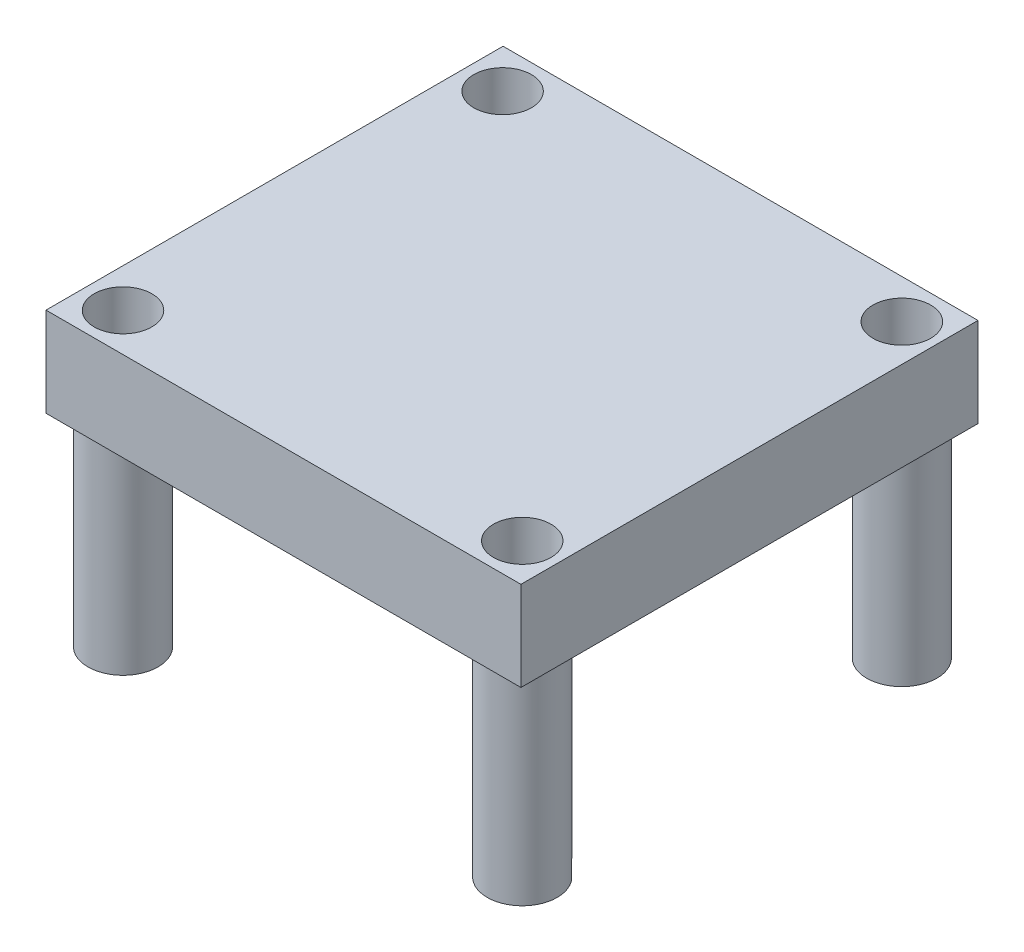
ISO-10303-21;
HEADER;
FILE_DESCRIPTION(('STEP AP214'),'2;1');
FILE_NAME('part.step','',(''),(''),'','','');
FILE_SCHEMA(('AUTOMOTIVE_DESIGN { 1 0 10303 214 1 1 1 1 }'));
ENDSEC;
DATA;
#1=APPLICATION_CONTEXT('core data for automotive mechanical design processes');
#2=APPLICATION_PROTOCOL_DEFINITION('international standard','automotive_design',2000,#1);
#3=PRODUCT_CONTEXT('',#1,'mechanical');
#4=PRODUCT('Part','Part','',(#3));
#5=PRODUCT_RELATED_PRODUCT_CATEGORY('part','',(#4));
#6=PRODUCT_DEFINITION_FORMATION('','',#4);
#7=PRODUCT_DEFINITION_CONTEXT('part definition',#1,'design');
#8=PRODUCT_DEFINITION('design','',#6,#7);
#9=PRODUCT_DEFINITION_SHAPE('','',#8);
#10=(LENGTH_UNIT() NAMED_UNIT(*) SI_UNIT(.MILLI.,.METRE.));
#11=(NAMED_UNIT(*) PLANE_ANGLE_UNIT() SI_UNIT($,.RADIAN.));
#12=(NAMED_UNIT(*) SI_UNIT($,.STERADIAN.) SOLID_ANGLE_UNIT());
#13=UNCERTAINTY_MEASURE_WITH_UNIT(LENGTH_MEASURE(1.E-05),#10,'distance_accuracy_value','');
#14=(GEOMETRIC_REPRESENTATION_CONTEXT(3) GLOBAL_UNCERTAINTY_ASSIGNED_CONTEXT((#13)) GLOBAL_UNIT_ASSIGNED_CONTEXT((#10,
#11,#12)) REPRESENTATION_CONTEXT('',''));
#15=CARTESIAN_POINT('',(0.,0.,0.));
#16=DIRECTION('',(0.,0.,1.));
#17=DIRECTION('',(1.,0.,0.));
#18=AXIS2_PLACEMENT_3D('',#15,#16,#17);
#19=CARTESIAN_POINT('',(-11.2828992805755,5.08,-10.6291690647482));
#20=DIRECTION('',(1.,0.,0.));
#21=DIRECTION('',(0.,0.,-1.));
#22=AXIS2_PLACEMENT_3D('',#19,#20,#21);
#23=PLANE('',#22);
#24=DIRECTION('',(0.,0.,1.));
#25=VECTOR('',#24,1.);
#26=CARTESIAN_POINT('',(-11.2828992805755,0.,-10.6291690647482));
#27=LINE('',#26,#25);
#28=CARTESIAN_POINT('',(-11.2828992805755,0.,-10.6291690647482));
#29=VERTEX_POINT('',#28);
#30=CARTESIAN_POINT('',(-11.2828992805755,0.,15.3550309352518));
#31=VERTEX_POINT('',#30);
#32=EDGE_CURVE('E104',#29,#31,#27,.T.);
#33=ORIENTED_EDGE('',*,*,#32,.T.);
#34=DIRECTION('',(0.,-1.,0.));
#35=VECTOR('',#34,1.);
#36=CARTESIAN_POINT('',(-11.2828992805755,5.08,15.3550309352518));
#37=LINE('',#36,#35);
#38=CARTESIAN_POINT('',(-11.2828992805755,5.08,15.3550309352518));
#39=VERTEX_POINT('',#38);
#40=EDGE_CURVE('E95',#39,#31,#37,.T.);
#41=ORIENTED_EDGE('',*,*,#40,.F.);
#42=DIRECTION('',(0.,0.,1.));
#43=VECTOR('',#42,1.);
#44=CARTESIAN_POINT('',(-11.2828992805755,5.08,-10.6291690647482));
#45=LINE('',#44,#43);
#46=CARTESIAN_POINT('',(-11.2828992805755,5.08,-10.6291690647482));
#47=VERTEX_POINT('',#46);
#48=EDGE_CURVE('E89',#47,#39,#45,.T.);
#49=ORIENTED_EDGE('',*,*,#48,.F.);
#50=DIRECTION('',(0.,-1.,0.));
#51=VECTOR('',#50,1.);
#52=CARTESIAN_POINT('',(-11.2828992805755,5.08,-10.6291690647482));
#53=LINE('',#52,#51);
#54=EDGE_CURVE('E100',#47,#29,#53,.T.);
#55=ORIENTED_EDGE('',*,*,#54,.T.);
#56=EDGE_LOOP('',(#33,#41,#49,#55));
#57=FACE_BOUND('',#56,.T.);
#58=ADVANCED_FACE('F37',(#57),#23,.F.);
#59=CARTESIAN_POINT('',(-11.2828992805755,5.08,15.3550309352518));
#60=DIRECTION('',(0.,0.,-1.));
#61=DIRECTION('',(-1.,0.,0.));
#62=AXIS2_PLACEMENT_3D('',#59,#60,#61);
#63=PLANE('',#62);
#64=DIRECTION('',(1.,0.,0.));
#65=VECTOR('',#64,1.);
#66=CARTESIAN_POINT('',(-11.2828992805755,0.,15.3550309352518));
#67=LINE('',#66,#65);
#68=CARTESIAN_POINT('',(15.7173007194245,0.,15.3550309352518));
#69=VERTEX_POINT('',#68);
#70=EDGE_CURVE('E94',#31,#69,#67,.T.);
#71=ORIENTED_EDGE('',*,*,#70,.T.);
#72=DIRECTION('',(0.,-1.,0.));
#73=VECTOR('',#72,1.);
#74=CARTESIAN_POINT('',(15.7173007194245,5.08,15.3550309352518));
#75=LINE('',#74,#73);
#76=CARTESIAN_POINT('',(15.7173007194245,5.08,15.3550309352518));
#77=VERTEX_POINT('',#76);
#78=EDGE_CURVE('E92',#77,#69,#75,.T.);
#79=ORIENTED_EDGE('',*,*,#78,.F.);
#80=DIRECTION('',(1.,0.,0.));
#81=VECTOR('',#80,1.);
#82=CARTESIAN_POINT('',(-11.2828992805755,5.08,15.3550309352518));
#83=LINE('',#82,#81);
#84=EDGE_CURVE('E84',#39,#77,#83,.T.);
#85=ORIENTED_EDGE('',*,*,#84,.F.);
#86=ORIENTED_EDGE('',*,*,#40,.T.);
#87=EDGE_LOOP('',(#71,#79,#85,#86));
#88=FACE_BOUND('',#87,.T.);
#89=ADVANCED_FACE('F93',(#88),#63,.F.);
#90=CARTESIAN_POINT('',(15.7173007194245,5.08,-10.6291690647482));
#91=DIRECTION('',(-1.,0.,0.));
#92=DIRECTION('',(0.,0.,1.));
#93=AXIS2_PLACEMENT_3D('',#90,#91,#92);
#94=PLANE('',#93);
#95=DIRECTION('',(0.,0.,-1.));
#96=VECTOR('',#95,1.);
#97=CARTESIAN_POINT('',(15.7173007194245,0.,-10.6291690647482));
#98=LINE('',#97,#96);
#99=CARTESIAN_POINT('',(15.7173007194245,0.,-10.6291690647482));
#100=VERTEX_POINT('',#99);
#101=EDGE_CURVE('E70',#69,#100,#98,.T.);
#102=ORIENTED_EDGE('',*,*,#101,.T.);
#103=DIRECTION('',(0.,-1.,0.));
#104=VECTOR('',#103,1.);
#105=CARTESIAN_POINT('',(15.7173007194245,5.08,-10.6291690647482));
#106=LINE('',#105,#104);
#107=CARTESIAN_POINT('',(15.7173007194245,5.08,-10.6291690647482));
#108=VERTEX_POINT('',#107);
#109=EDGE_CURVE('E96',#108,#100,#106,.T.);
#110=ORIENTED_EDGE('',*,*,#109,.F.);
#111=DIRECTION('',(0.,0.,-1.));
#112=VECTOR('',#111,1.);
#113=CARTESIAN_POINT('',(15.7173007194245,5.08,-10.6291690647482));
#114=LINE('',#113,#112);
#115=EDGE_CURVE('E87',#77,#108,#114,.T.);
#116=ORIENTED_EDGE('',*,*,#115,.F.);
#117=ORIENTED_EDGE('',*,*,#78,.T.);
#118=EDGE_LOOP('',(#102,#110,#116,#117));
#119=FACE_BOUND('',#118,.T.);
#120=ADVANCED_FACE('F98',(#119),#94,.F.);
#121=CARTESIAN_POINT('',(-11.2828992805755,5.08,-10.6291690647482));
#122=DIRECTION('',(0.,0.,1.));
#123=DIRECTION('',(1.,0.,0.));
#124=AXIS2_PLACEMENT_3D('',#121,#122,#123);
#125=PLANE('',#124);
#126=DIRECTION('',(-1.,0.,0.));
#127=VECTOR('',#126,1.);
#128=CARTESIAN_POINT('',(-11.2828992805755,0.,-10.6291690647482));
#129=LINE('',#128,#127);
#130=EDGE_CURVE('E76',#100,#29,#129,.T.);
#131=ORIENTED_EDGE('',*,*,#130,.T.);
#132=ORIENTED_EDGE('',*,*,#54,.F.);
#133=DIRECTION('',(-1.,0.,0.));
#134=VECTOR('',#133,1.);
#135=CARTESIAN_POINT('',(-11.2828992805755,5.08,-10.6291690647482));
#136=LINE('',#135,#134);
#137=EDGE_CURVE('E53',#108,#47,#136,.T.);
#138=ORIENTED_EDGE('',*,*,#137,.F.);
#139=ORIENTED_EDGE('',*,*,#109,.T.);
#140=EDGE_LOOP('',(#131,#132,#138,#139));
#141=FACE_BOUND('',#140,.T.);
#142=ADVANCED_FACE('F136',(#141),#125,.F.);
#143=CARTESIAN_POINT('',(0.,5.08,0.));
#144=DIRECTION('',(0.,1.,0.));
#145=DIRECTION('',(0.,0.,1.));
#146=AXIS2_PLACEMENT_3D('',#143,#144,#145);
#147=PLANE('',#146);
#148=CARTESIAN_POINT('',(-9.08269961067136,5.08,-8.40305308869703));
#149=DIRECTION('',(0.,1.,0.));
#150=DIRECTION('',(0.,0.,1.));
#151=AXIS2_PLACEMENT_3D('',#148,#149,#150);
#152=CIRCLE('',#151,1.6383);
#153=CARTESIAN_POINT('',(-9.08269961067136,5.08,-6.76475308869703));
#154=VERTEX_POINT('',#153);
#155=EDGE_CURVE('E353',#154,#154,#152,.T.);
#156=ORIENTED_EDGE('',*,*,#155,.F.);
#157=EDGE_LOOP('',(#156));
#158=FACE_BOUND('',#157,.T.);
#159=CARTESIAN_POINT('',(13.6127278506212,5.08,13.1767283597511));
#160=DIRECTION('',(0.,1.,0.));
#161=DIRECTION('',(0.,0.,1.));
#162=AXIS2_PLACEMENT_3D('',#159,#160,#161);
#163=CIRCLE('',#162,1.6383);
#164=CARTESIAN_POINT('',(13.6127278506212,5.08,14.8150283597511));
#165=VERTEX_POINT('',#164);
#166=EDGE_CURVE('E358',#165,#165,#163,.T.);
#167=ORIENTED_EDGE('',*,*,#166,.F.);
#168=EDGE_LOOP('',(#167));
#169=FACE_BOUND('',#168,.T.);
#170=CARTESIAN_POINT('',(-9.08269961067136,5.08,13.1767283597511));
#171=DIRECTION('',(0.,1.,0.));
#172=DIRECTION('',(0.,0.,1.));
#173=AXIS2_PLACEMENT_3D('',#170,#171,#172);
#174=CIRCLE('',#173,1.6383);
#175=CARTESIAN_POINT('',(-9.08269961067136,5.08,14.8150283597511));
#176=VERTEX_POINT('',#175);
#177=EDGE_CURVE('E387',#176,#176,#174,.T.);
#178=ORIENTED_EDGE('',*,*,#177,.F.);
#179=EDGE_LOOP('',(#178));
#180=FACE_BOUND('',#179,.T.);
#181=CARTESIAN_POINT('',(13.6127278506212,5.08,-8.40305308869703));
#182=DIRECTION('',(0.,1.,0.));
#183=DIRECTION('',(0.,0.,1.));
#184=AXIS2_PLACEMENT_3D('',#181,#182,#183);
#185=CIRCLE('',#184,1.64159341889953);
#186=CARTESIAN_POINT('',(13.6127278506212,5.08,-6.76145966979751));
#187=VERTEX_POINT('',#186);
#188=EDGE_CURVE('E351',#187,#187,#185,.T.);
#189=ORIENTED_EDGE('',*,*,#188,.F.);
#190=EDGE_LOOP('',(#189));
#191=FACE_BOUND('',#190,.T.);
#192=ORIENTED_EDGE('',*,*,#48,.T.);
#193=ORIENTED_EDGE('',*,*,#84,.T.);
#194=ORIENTED_EDGE('',*,*,#115,.T.);
#195=ORIENTED_EDGE('',*,*,#137,.T.);
#196=EDGE_LOOP('',(#192,#193,#194,#195));
#197=FACE_BOUND('',#196,.T.);
#198=ADVANCED_FACE('F85',(#158,#169,#180,#191,#197),#147,.T.);
#199=CARTESIAN_POINT('',(0.,0.,0.));
#200=DIRECTION('',(0.,1.,0.));
#201=DIRECTION('',(0.,0.,1.));
#202=AXIS2_PLACEMENT_3D('',#199,#200,#201);
#203=PLANE('',#202);
#204=CARTESIAN_POINT('',(13.6127278506212,0.,-8.40305308869703));
#205=DIRECTION('',(0.,1.,0.));
#206=DIRECTION('',(0.,0.,1.));
#207=AXIS2_PLACEMENT_3D('',#204,#205,#206);
#208=CIRCLE('',#207,1.9939);
#209=CARTESIAN_POINT('',(13.6127278506212,0.,-6.40915308869703));
#210=VERTEX_POINT('',#209);
#211=EDGE_CURVE('E11',#210,#210,#208,.F.);
#212=ORIENTED_EDGE('',*,*,#211,.F.);
#213=EDGE_LOOP('',(#212));
#214=FACE_BOUND('',#213,.T.);
#215=CARTESIAN_POINT('',(-9.08269961067136,0.,-8.40305308869703));
#216=DIRECTION('',(0.,1.,0.));
#217=DIRECTION('',(0.,0.,1.));
#218=AXIS2_PLACEMENT_3D('',#215,#216,#217);
#219=CIRCLE('',#218,1.9939);
#220=CARTESIAN_POINT('',(-9.08269961067136,0.,-6.40915308869703));
#221=VERTEX_POINT('',#220);
#222=EDGE_CURVE('E45',#221,#221,#219,.F.);
#223=ORIENTED_EDGE('',*,*,#222,.F.);
#224=EDGE_LOOP('',(#223));
#225=FACE_BOUND('',#224,.T.);
#226=CARTESIAN_POINT('',(13.6127278506212,0.,13.1767283597511));
#227=DIRECTION('',(0.,1.,0.));
#228=DIRECTION('',(0.,0.,1.));
#229=AXIS2_PLACEMENT_3D('',#226,#227,#228);
#230=CIRCLE('',#229,1.9939);
#231=CARTESIAN_POINT('',(13.6127278506212,0.,15.1706283597511));
#232=VERTEX_POINT('',#231);
#233=EDGE_CURVE('E117',#232,#232,#230,.F.);
#234=ORIENTED_EDGE('',*,*,#233,.F.);
#235=EDGE_LOOP('',(#234));
#236=FACE_BOUND('',#235,.T.);
#237=CARTESIAN_POINT('',(-9.08269961067136,0.,13.1767283597511));
#238=DIRECTION('',(0.,1.,0.));
#239=DIRECTION('',(0.,0.,1.));
#240=AXIS2_PLACEMENT_3D('',#237,#238,#239);
#241=CIRCLE('',#240,1.9939);
#242=CARTESIAN_POINT('',(-9.08269961067136,0.,15.1706283597511));
#243=VERTEX_POINT('',#242);
#244=EDGE_CURVE('E114',#243,#243,#241,.F.);
#245=ORIENTED_EDGE('',*,*,#244,.F.);
#246=EDGE_LOOP('',(#245));
#247=FACE_BOUND('',#246,.T.);
#248=ORIENTED_EDGE('',*,*,#32,.F.);
#249=ORIENTED_EDGE('',*,*,#130,.F.);
#250=ORIENTED_EDGE('',*,*,#101,.F.);
#251=ORIENTED_EDGE('',*,*,#70,.F.);
#252=EDGE_LOOP('',(#248,#249,#250,#251));
#253=FACE_BOUND('',#252,.T.);
#254=ADVANCED_FACE('F124',(#214,#225,#236,#247,#253),#203,.F.);
#255=CARTESIAN_POINT('',(-9.08269961067136,-11.4808,13.1767283597511));
#256=DIRECTION('',(0.,-1.,0.));
#257=DIRECTION('',(0.,0.,-1.));
#258=AXIS2_PLACEMENT_3D('',#255,#256,#257);
#259=PLANE('',#258);
#260=CARTESIAN_POINT('',(-9.08269961067136,-11.4808,13.1767283597511));
#261=DIRECTION('',(0.,-1.,0.));
#262=DIRECTION('',(0.,0.,-1.));
#263=AXIS2_PLACEMENT_3D('',#260,#261,#262);
#264=CIRCLE('',#263,1.9939);
#265=CARTESIAN_POINT('',(-9.08269961067136,-11.4808,11.1828283597511));
#266=VERTEX_POINT('',#265);
#267=EDGE_CURVE('E107',#266,#266,#264,.T.);
#268=ORIENTED_EDGE('',*,*,#267,.T.);
#269=EDGE_LOOP('',(#268));
#270=FACE_BOUND('',#269,.T.);
#271=CARTESIAN_POINT('',(-9.08269961067136,-11.4808,13.1767283597511));
#272=DIRECTION('',(0.,-1.,0.));
#273=DIRECTION('',(0.,0.,-1.));
#274=AXIS2_PLACEMENT_3D('',#271,#272,#273);
#275=CIRCLE('',#274,1.6383);
#276=CARTESIAN_POINT('',(-9.08269961067136,-11.4808,11.5384283597511));
#277=VERTEX_POINT('',#276);
#278=EDGE_CURVE('E376',#277,#277,#275,.T.);
#279=ORIENTED_EDGE('',*,*,#278,.F.);
#280=EDGE_LOOP('',(#279));
#281=FACE_BOUND('',#280,.T.);
#282=ADVANCED_FACE('F127',(#270,#281),#259,.T.);
#283=CARTESIAN_POINT('',(-9.08269961067136,-11.4808,13.1767283597511));
#284=DIRECTION('',(0.,1.,0.));
#285=DIRECTION('',(0.,0.,1.));
#286=AXIS2_PLACEMENT_3D('',#283,#284,#285);
#287=CYLINDRICAL_SURFACE('',#286,1.9939);
#288=ORIENTED_EDGE('',*,*,#267,.F.);
#289=EDGE_LOOP('',(#288));
#290=FACE_BOUND('',#289,.T.);
#291=ORIENTED_EDGE('',*,*,#244,.T.);
#292=EDGE_LOOP('',(#291));
#293=FACE_BOUND('',#292,.T.);
#294=ADVANCED_FACE('F179',(#290,#293),#287,.T.);
#295=CARTESIAN_POINT('',(-9.08269961067136,-11.4808,13.1767283597511));
#296=DIRECTION('',(0.,1.,0.));
#297=DIRECTION('',(0.,0.,1.));
#298=AXIS2_PLACEMENT_3D('',#295,#296,#297);
#299=CYLINDRICAL_SURFACE('',#298,1.6383);
#300=ORIENTED_EDGE('',*,*,#278,.T.);
#301=EDGE_LOOP('',(#300));
#302=FACE_BOUND('',#301,.T.);
#303=ORIENTED_EDGE('',*,*,#177,.T.);
#304=EDGE_LOOP('',(#303));
#305=FACE_BOUND('',#304,.T.);
#306=ADVANCED_FACE('F190',(#302,#305),#299,.F.);
#307=CARTESIAN_POINT('',(13.6127278506212,-11.4808,13.1767283597511));
#308=DIRECTION('',(0.,-1.,0.));
#309=DIRECTION('',(0.,0.,-1.));
#310=AXIS2_PLACEMENT_3D('',#307,#308,#309);
#311=PLANE('',#310);
#312=CARTESIAN_POINT('',(13.6127278506212,-11.4808,13.1767283597511));
#313=DIRECTION('',(0.,-1.,0.));
#314=DIRECTION('',(0.,0.,-1.));
#315=AXIS2_PLACEMENT_3D('',#312,#313,#314);
#316=CIRCLE('',#315,1.9939);
#317=CARTESIAN_POINT('',(13.6127278506212,-11.4808,11.1828283597511));
#318=VERTEX_POINT('',#317);
#319=EDGE_CURVE('E370',#318,#318,#316,.T.);
#320=ORIENTED_EDGE('',*,*,#319,.T.);
#321=EDGE_LOOP('',(#320));
#322=FACE_BOUND('',#321,.T.);
#323=CARTESIAN_POINT('',(13.6127278506212,-11.4808,13.1767283597511));
#324=DIRECTION('',(0.,-1.,0.));
#325=DIRECTION('',(0.,0.,-1.));
#326=AXIS2_PLACEMENT_3D('',#323,#324,#325);
#327=CIRCLE('',#326,1.6383);
#328=CARTESIAN_POINT('',(13.6127278506212,-11.4808,11.5384283597511));
#329=VERTEX_POINT('',#328);
#330=EDGE_CURVE('E373',#329,#329,#327,.T.);
#331=ORIENTED_EDGE('',*,*,#330,.F.);
#332=EDGE_LOOP('',(#331));
#333=FACE_BOUND('',#332,.T.);
#334=ADVANCED_FACE('F199',(#322,#333),#311,.T.);
#335=CARTESIAN_POINT('',(13.6127278506212,-11.4808,13.1767283597511));
#336=DIRECTION('',(0.,1.,0.));
#337=DIRECTION('',(0.,0.,1.));
#338=AXIS2_PLACEMENT_3D('',#335,#336,#337);
#339=CYLINDRICAL_SURFACE('',#338,1.9939);
#340=ORIENTED_EDGE('',*,*,#319,.F.);
#341=EDGE_LOOP('',(#340));
#342=FACE_BOUND('',#341,.T.);
#343=ORIENTED_EDGE('',*,*,#233,.T.);
#344=EDGE_LOOP('',(#343));
#345=FACE_BOUND('',#344,.T.);
#346=ADVANCED_FACE('F204',(#342,#345),#339,.T.);
#347=CARTESIAN_POINT('',(13.6127278506212,-11.4808,13.1767283597511));
#348=DIRECTION('',(0.,1.,0.));
#349=DIRECTION('',(0.,0.,1.));
#350=AXIS2_PLACEMENT_3D('',#347,#348,#349);
#351=CYLINDRICAL_SURFACE('',#350,1.6383);
#352=ORIENTED_EDGE('',*,*,#330,.T.);
#353=EDGE_LOOP('',(#352));
#354=FACE_BOUND('',#353,.T.);
#355=ORIENTED_EDGE('',*,*,#166,.T.);
#356=EDGE_LOOP('',(#355));
#357=FACE_BOUND('',#356,.T.);
#358=ADVANCED_FACE('F215',(#354,#357),#351,.F.);
#359=CARTESIAN_POINT('',(-9.08269961067136,-11.4808,-8.40305308869703));
#360=DIRECTION('',(0.,-1.,0.));
#361=DIRECTION('',(0.,0.,-1.));
#362=AXIS2_PLACEMENT_3D('',#359,#360,#361);
#363=PLANE('',#362);
#364=CARTESIAN_POINT('',(-9.08269961067136,-11.4808,-8.40305308869703));
#365=DIRECTION('',(0.,-1.,0.));
#366=DIRECTION('',(0.,0.,-1.));
#367=AXIS2_PLACEMENT_3D('',#364,#365,#366);
#368=CIRCLE('',#367,1.9939);
#369=CARTESIAN_POINT('',(-9.08269961067136,-11.4808,-10.396953088697));
#370=VERTEX_POINT('',#369);
#371=EDGE_CURVE('E364',#370,#370,#368,.T.);
#372=ORIENTED_EDGE('',*,*,#371,.T.);
#373=EDGE_LOOP('',(#372));
#374=FACE_BOUND('',#373,.T.);
#375=CARTESIAN_POINT('',(-9.08269961067136,-11.4808,-8.40305308869703));
#376=DIRECTION('',(0.,-1.,0.));
#377=DIRECTION('',(0.,0.,-1.));
#378=AXIS2_PLACEMENT_3D('',#375,#376,#377);
#379=CIRCLE('',#378,1.6383);
#380=CARTESIAN_POINT('',(-9.08269961067136,-11.4808,-10.041353088697));
#381=VERTEX_POINT('',#380);
#382=EDGE_CURVE('E367',#381,#381,#379,.T.);
#383=ORIENTED_EDGE('',*,*,#382,.F.);
#384=EDGE_LOOP('',(#383));
#385=FACE_BOUND('',#384,.T.);
#386=ADVANCED_FACE('F224',(#374,#385),#363,.T.);
#387=CARTESIAN_POINT('',(-9.08269961067136,-11.4808,-8.40305308869703));
#388=DIRECTION('',(0.,1.,0.));
#389=DIRECTION('',(0.,0.,1.));
#390=AXIS2_PLACEMENT_3D('',#387,#388,#389);
#391=CYLINDRICAL_SURFACE('',#390,1.9939);
#392=ORIENTED_EDGE('',*,*,#371,.F.);
#393=EDGE_LOOP('',(#392));
#394=FACE_BOUND('',#393,.T.);
#395=ORIENTED_EDGE('',*,*,#222,.T.);
#396=EDGE_LOOP('',(#395));
#397=FACE_BOUND('',#396,.T.);
#398=ADVANCED_FACE('F122',(#394,#397),#391,.T.);
#399=CARTESIAN_POINT('',(-9.08269961067136,-11.4808,-8.40305308869703));
#400=DIRECTION('',(0.,1.,0.));
#401=DIRECTION('',(0.,0.,1.));
#402=AXIS2_PLACEMENT_3D('',#399,#400,#401);
#403=CYLINDRICAL_SURFACE('',#402,1.6383);
#404=ORIENTED_EDGE('',*,*,#382,.T.);
#405=EDGE_LOOP('',(#404));
#406=FACE_BOUND('',#405,.T.);
#407=ORIENTED_EDGE('',*,*,#155,.T.);
#408=EDGE_LOOP('',(#407));
#409=FACE_BOUND('',#408,.T.);
#410=ADVANCED_FACE('F239',(#406,#409),#403,.F.);
#411=CARTESIAN_POINT('',(13.6127278506212,-11.4808,-8.40305308869703));
#412=DIRECTION('',(0.,-1.,0.));
#413=DIRECTION('',(0.,0.,-1.));
#414=AXIS2_PLACEMENT_3D('',#411,#412,#413);
#415=PLANE('',#414);
#416=CARTESIAN_POINT('',(13.6127278506212,-11.4808,-8.40305308869703));
#417=DIRECTION('',(0.,1.,0.));
#418=DIRECTION('',(0.,0.,1.));
#419=AXIS2_PLACEMENT_3D('',#416,#417,#418);
#420=CIRCLE('',#419,1.64159341889953);
#421=CARTESIAN_POINT('',(13.6127278506212,-11.4808,-6.76145966979751));
#422=VERTEX_POINT('',#421);
#423=EDGE_CURVE('E348',#422,#422,#420,.T.);
#424=ORIENTED_EDGE('',*,*,#423,.T.);
#425=EDGE_LOOP('',(#424));
#426=FACE_BOUND('',#425,.T.);
#427=CARTESIAN_POINT('',(13.6127278506212,-11.4808,-8.40305308869703));
#428=DIRECTION('',(0.,-1.,0.));
#429=DIRECTION('',(0.,0.,-1.));
#430=AXIS2_PLACEMENT_3D('',#427,#428,#429);
#431=CIRCLE('',#430,1.9939);
#432=CARTESIAN_POINT('',(13.6127278506212,-11.4808,-10.396953088697));
#433=VERTEX_POINT('',#432);
#434=EDGE_CURVE('E355',#433,#433,#431,.T.);
#435=ORIENTED_EDGE('',*,*,#434,.T.);
#436=EDGE_LOOP('',(#435));
#437=FACE_BOUND('',#436,.T.);
#438=ADVANCED_FACE('F254',(#426,#437),#415,.T.);
#439=CARTESIAN_POINT('',(13.6127278506212,-11.4808,-8.40305308869703));
#440=DIRECTION('',(0.,1.,0.));
#441=DIRECTION('',(0.,0.,1.));
#442=AXIS2_PLACEMENT_3D('',#439,#440,#441);
#443=CYLINDRICAL_SURFACE('',#442,1.9939);
#444=ORIENTED_EDGE('',*,*,#434,.F.);
#445=EDGE_LOOP('',(#444));
#446=FACE_BOUND('',#445,.T.);
#447=ORIENTED_EDGE('',*,*,#211,.T.);
#448=EDGE_LOOP('',(#447));
#449=FACE_BOUND('',#448,.T.);
#450=ADVANCED_FACE('F248',(#446,#449),#443,.T.);
#451=CARTESIAN_POINT('',(13.6127278506212,-11.4808,-8.40305308869703));
#452=DIRECTION('',(0.,1.,0.));
#453=DIRECTION('',(0.,0.,1.));
#454=AXIS2_PLACEMENT_3D('',#451,#452,#453);
#455=CYLINDRICAL_SURFACE('',#454,1.64159341889953);
#456=ORIENTED_EDGE('',*,*,#423,.F.);
#457=EDGE_LOOP('',(#456));
#458=FACE_BOUND('',#457,.T.);
#459=ORIENTED_EDGE('',*,*,#188,.T.);
#460=EDGE_LOOP('',(#459));
#461=FACE_BOUND('',#460,.T.);
#462=ADVANCED_FACE('F253',(#458,#461),#455,.F.);
#463=CLOSED_SHELL('',(#58,#89,#120,#142,#198,#254,#282,#294,#306,#334,#346,#358,#386,#398,#410,
#438,#450,#462));
#464=MANIFOLD_SOLID_BREP('B2',#463);
#465=ADVANCED_BREP_SHAPE_REPRESENTATION('',(#18,#464),#14);
#466=SHAPE_DEFINITION_REPRESENTATION(#9,#465);
ENDSEC;
END-ISO-10303-21;
